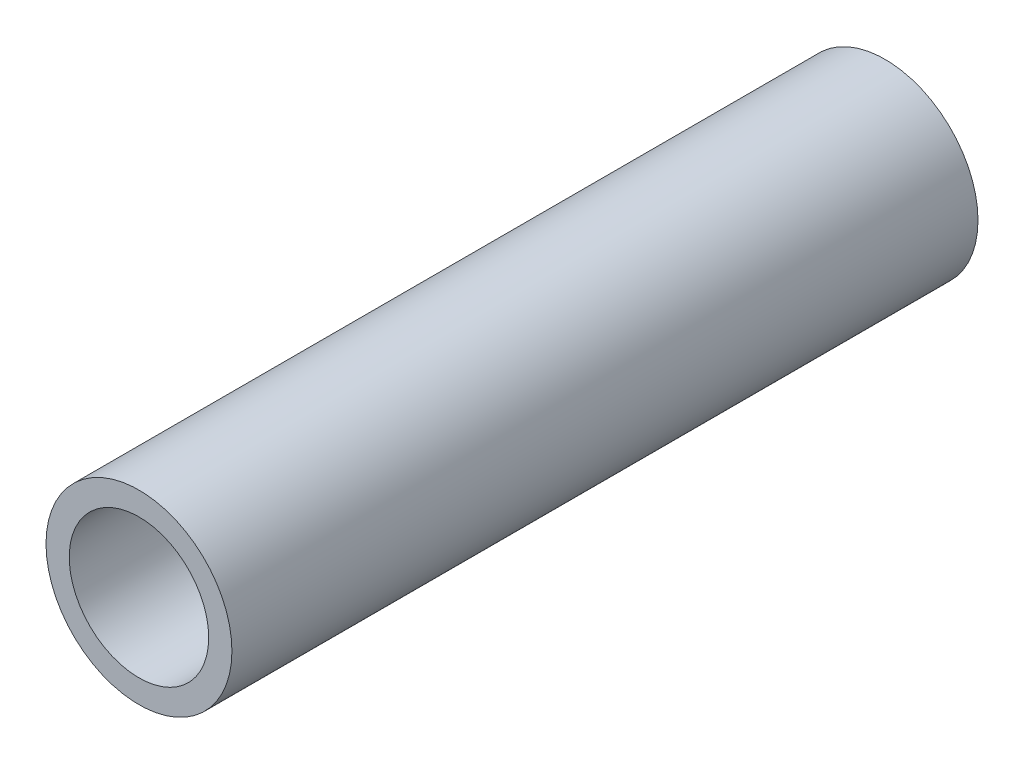
ISO-10303-21;
HEADER;
FILE_DESCRIPTION(('STEP AP214'),'2;1');
FILE_NAME('part.step','',(''),(''),'','','');
FILE_SCHEMA(('AUTOMOTIVE_DESIGN { 1 0 10303 214 1 1 1 1 }'));
ENDSEC;
DATA;
#1=APPLICATION_CONTEXT('core data for automotive mechanical design processes');
#2=APPLICATION_PROTOCOL_DEFINITION('international standard','automotive_design',2000,#1);
#3=PRODUCT_CONTEXT('',#1,'mechanical');
#4=PRODUCT('Part','Part','',(#3));
#5=PRODUCT_RELATED_PRODUCT_CATEGORY('part','',(#4));
#6=PRODUCT_DEFINITION_FORMATION('','',#4);
#7=PRODUCT_DEFINITION_CONTEXT('part definition',#1,'design');
#8=PRODUCT_DEFINITION('design','',#6,#7);
#9=PRODUCT_DEFINITION_SHAPE('','',#8);
#10=(LENGTH_UNIT() NAMED_UNIT(*) SI_UNIT(.MILLI.,.METRE.));
#11=(NAMED_UNIT(*) PLANE_ANGLE_UNIT() SI_UNIT($,.RADIAN.));
#12=(NAMED_UNIT(*) SI_UNIT($,.STERADIAN.) SOLID_ANGLE_UNIT());
#13=UNCERTAINTY_MEASURE_WITH_UNIT(LENGTH_MEASURE(1.E-05),#10,'distance_accuracy_value','');
#14=(GEOMETRIC_REPRESENTATION_CONTEXT(3) GLOBAL_UNCERTAINTY_ASSIGNED_CONTEXT((#13)) GLOBAL_UNIT_ASSIGNED_CONTEXT((#10,
#11,#12)) REPRESENTATION_CONTEXT('',''));
#15=CARTESIAN_POINT('',(0.,0.,0.));
#16=DIRECTION('',(0.,0.,1.));
#17=DIRECTION('',(1.,0.,0.));
#18=AXIS2_PLACEMENT_3D('',#15,#16,#17);
#19=CARTESIAN_POINT('',(0.,0.,33.9725));
#20=DIRECTION('',(0.,0.,1.));
#21=DIRECTION('',(1.,0.,0.));
#22=AXIS2_PLACEMENT_3D('',#19,#20,#21);
#23=PLANE('',#22);
#24=CARTESIAN_POINT('',(0.,0.,33.9725));
#25=DIRECTION('',(0.,0.,1.));
#26=DIRECTION('',(1.,0.,0.));
#27=AXIS2_PLACEMENT_3D('',#24,#25,#26);
#28=CIRCLE('',#27,4.23333333333333);
#29=CARTESIAN_POINT('',(4.23333333333333,0.,33.9725));
#30=VERTEX_POINT('',#29);
#31=EDGE_CURVE('E10',#30,#30,#28,.T.);
#32=ORIENTED_EDGE('',*,*,#31,.T.);
#33=EDGE_LOOP('',(#32));
#34=FACE_BOUND('',#33,.T.);
#35=CARTESIAN_POINT('',(0.,0.,33.9725));
#36=DIRECTION('',(0.,0.,1.));
#37=DIRECTION('',(1.,0.,0.));
#38=AXIS2_PLACEMENT_3D('',#35,#36,#37);
#39=CIRCLE('',#38,3.175);
#40=CARTESIAN_POINT('',(3.175,0.,33.9725));
#41=VERTEX_POINT('',#40);
#42=EDGE_CURVE('E41',#41,#41,#39,.T.);
#43=ORIENTED_EDGE('',*,*,#42,.F.);
#44=EDGE_LOOP('',(#43));
#45=FACE_BOUND('',#44,.T.);
#46=ADVANCED_FACE('F30',(#34,#45),#23,.T.);
#47=CARTESIAN_POINT('',(0.,0.,0.));
#48=DIRECTION('',(0.,0.,1.));
#49=DIRECTION('',(1.,0.,0.));
#50=AXIS2_PLACEMENT_3D('',#47,#48,#49);
#51=PLANE('',#50);
#52=CARTESIAN_POINT('',(0.,0.,0.));
#53=DIRECTION('',(0.,0.,1.));
#54=DIRECTION('',(1.,0.,0.));
#55=AXIS2_PLACEMENT_3D('',#52,#53,#54);
#56=CIRCLE('',#55,4.23333333333333);
#57=CARTESIAN_POINT('',(4.23333333333333,0.,0.));
#58=VERTEX_POINT('',#57);
#59=EDGE_CURVE('E34',#58,#58,#56,.T.);
#60=ORIENTED_EDGE('',*,*,#59,.F.);
#61=EDGE_LOOP('',(#60));
#62=FACE_BOUND('',#61,.T.);
#63=CARTESIAN_POINT('',(0.,0.,0.));
#64=DIRECTION('',(0.,0.,1.));
#65=DIRECTION('',(1.,0.,0.));
#66=AXIS2_PLACEMENT_3D('',#63,#64,#65);
#67=CIRCLE('',#66,3.175);
#68=CARTESIAN_POINT('',(3.175,0.,0.));
#69=VERTEX_POINT('',#68);
#70=EDGE_CURVE('E43',#69,#69,#67,.T.);
#71=ORIENTED_EDGE('',*,*,#70,.T.);
#72=EDGE_LOOP('',(#71));
#73=FACE_BOUND('',#72,.T.);
#74=ADVANCED_FACE('F53',(#62,#73),#51,.F.);
#75=CARTESIAN_POINT('',(0.,0.,33.9725));
#76=DIRECTION('',(0.,0.,-1.));
#77=DIRECTION('',(-1.,0.,0.));
#78=AXIS2_PLACEMENT_3D('',#75,#76,#77);
#79=CYLINDRICAL_SURFACE('',#78,4.23333333333333);
#80=ORIENTED_EDGE('',*,*,#31,.F.);
#81=EDGE_LOOP('',(#80));
#82=FACE_BOUND('',#81,.T.);
#83=ORIENTED_EDGE('',*,*,#59,.T.);
#84=EDGE_LOOP('',(#83));
#85=FACE_BOUND('',#84,.T.);
#86=ADVANCED_FACE('F32',(#82,#85),#79,.T.);
#87=CARTESIAN_POINT('',(0.,0.,33.9725));
#88=DIRECTION('',(0.,0.,-1.));
#89=DIRECTION('',(-1.,0.,0.));
#90=AXIS2_PLACEMENT_3D('',#87,#88,#89);
#91=CYLINDRICAL_SURFACE('',#90,3.175);
#92=ORIENTED_EDGE('',*,*,#42,.T.);
#93=EDGE_LOOP('',(#92));
#94=FACE_BOUND('',#93,.T.);
#95=ORIENTED_EDGE('',*,*,#70,.F.);
#96=EDGE_LOOP('',(#95));
#97=FACE_BOUND('',#96,.T.);
#98=ADVANCED_FACE('F49',(#94,#97),#91,.F.);
#99=CLOSED_SHELL('',(#46,#74,#86,#98));
#100=MANIFOLD_SOLID_BREP('B2',#99);
#101=ADVANCED_BREP_SHAPE_REPRESENTATION('',(#18,#100),#14);
#102=SHAPE_DEFINITION_REPRESENTATION(#9,#101);
ENDSEC;
END-ISO-10303-21;
